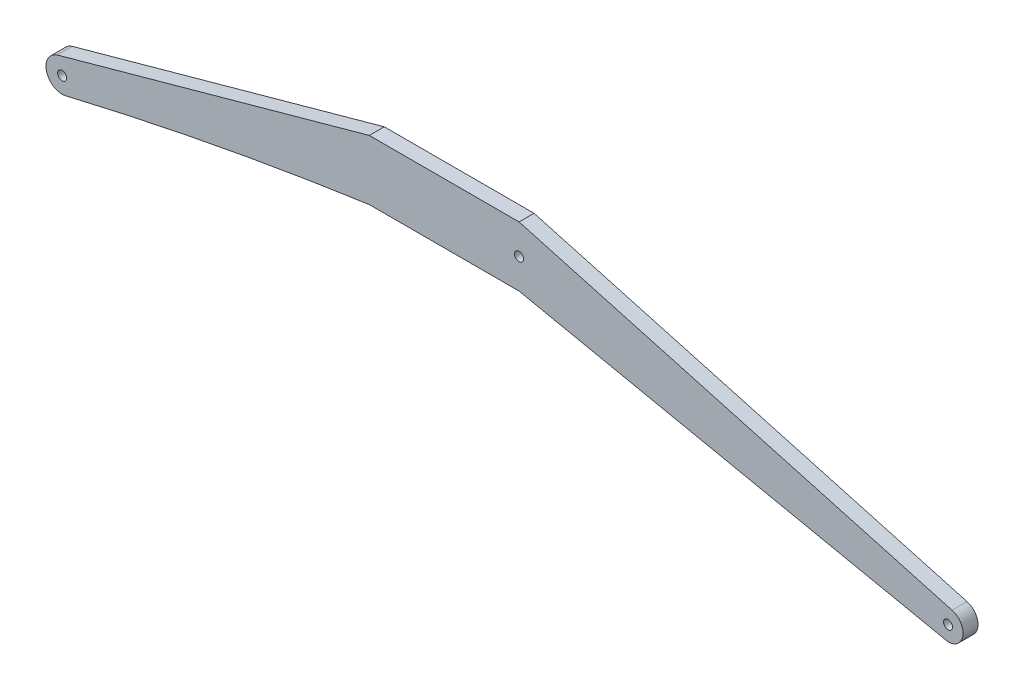
ISO-10303-21;
HEADER;
FILE_DESCRIPTION(('STEP AP214'),'2;1');
FILE_NAME('part.step','',(''),(''),'','','');
FILE_SCHEMA(('AUTOMOTIVE_DESIGN { 1 0 10303 214 1 1 1 1 }'));
ENDSEC;
DATA;
#1=APPLICATION_CONTEXT('core data for automotive mechanical design processes');
#2=APPLICATION_PROTOCOL_DEFINITION('international standard','automotive_design',2000,#1);
#3=PRODUCT_CONTEXT('',#1,'mechanical');
#4=PRODUCT('Part','Part','',(#3));
#5=PRODUCT_RELATED_PRODUCT_CATEGORY('part','',(#4));
#6=PRODUCT_DEFINITION_FORMATION('','',#4);
#7=PRODUCT_DEFINITION_CONTEXT('part definition',#1,'design');
#8=PRODUCT_DEFINITION('design','',#6,#7);
#9=PRODUCT_DEFINITION_SHAPE('','',#8);
#10=(LENGTH_UNIT() NAMED_UNIT(*) SI_UNIT(.MILLI.,.METRE.));
#11=(NAMED_UNIT(*) PLANE_ANGLE_UNIT() SI_UNIT($,.RADIAN.));
#12=(NAMED_UNIT(*) SI_UNIT($,.STERADIAN.) SOLID_ANGLE_UNIT());
#13=UNCERTAINTY_MEASURE_WITH_UNIT(LENGTH_MEASURE(1.E-05),#10,'distance_accuracy_value','');
#14=(GEOMETRIC_REPRESENTATION_CONTEXT(3) GLOBAL_UNCERTAINTY_ASSIGNED_CONTEXT((#13)) GLOBAL_UNIT_ASSIGNED_CONTEXT((#10,
#11,#12)) REPRESENTATION_CONTEXT('',''));
#15=CARTESIAN_POINT('',(0.,0.,0.));
#16=DIRECTION('',(0.,0.,1.));
#17=DIRECTION('',(1.,0.,0.));
#18=AXIS2_PLACEMENT_3D('',#15,#16,#17);
#19=CARTESIAN_POINT('',(-25.5100344515738,-5.62123459327254,1.));
#20=DIRECTION('',(0.,0.,-1.));
#21=DIRECTION('',(-1.,0.,0.));
#22=AXIS2_PLACEMENT_3D('',#19,#20,#21);
#23=CYLINDRICAL_SURFACE('',#22,1.0782818882512);
#24=CARTESIAN_POINT('',(-25.5100344515738,-5.62123459327254,0.));
#25=DIRECTION('',(0.,0.,1.));
#26=DIRECTION('',(1.,0.,0.));
#27=AXIS2_PLACEMENT_3D('',#24,#25,#26);
#28=CIRCLE('',#27,1.0782818882512);
#29=CARTESIAN_POINT('',(-25.8358261445183,-4.59334763288295,0.));
#30=VERTEX_POINT('',#29);
#31=CARTESIAN_POINT('',(-25.2611361471443,-6.67039686126672,0.));
#32=VERTEX_POINT('',#31);
#33=EDGE_CURVE('E142',#30,#32,#28,.T.);
#34=ORIENTED_EDGE('',*,*,#33,.T.);
#35=DIRECTION('',(0.,0.,-1.));
#36=VECTOR('',#35,1.);
#37=CARTESIAN_POINT('',(-25.2611361471443,-6.67039686126672,1.));
#38=LINE('',#37,#36);
#39=CARTESIAN_POINT('',(-25.2611361471443,-6.67039686126672,1.));
#40=VERTEX_POINT('',#39);
#41=EDGE_CURVE('E11',#40,#32,#38,.T.);
#42=ORIENTED_EDGE('',*,*,#41,.F.);
#43=CARTESIAN_POINT('',(-25.5100344515738,-5.62123459327254,1.));
#44=DIRECTION('',(0.,0.,1.));
#45=DIRECTION('',(1.,0.,0.));
#46=AXIS2_PLACEMENT_3D('',#43,#44,#45);
#47=CIRCLE('',#46,1.0782818882512);
#48=CARTESIAN_POINT('',(-25.8358261445183,-4.59334763288295,1.));
#49=VERTEX_POINT('',#48);
#50=EDGE_CURVE('E168',#49,#40,#47,.T.);
#51=ORIENTED_EDGE('',*,*,#50,.F.);
#52=DIRECTION('',(0.,0.,-1.));
#53=VECTOR('',#52,1.);
#54=CARTESIAN_POINT('',(-25.8358261445183,-4.59334763288295,1.));
#55=LINE('',#54,#53);
#56=EDGE_CURVE('E141',#49,#30,#55,.T.);
#57=ORIENTED_EDGE('',*,*,#56,.T.);
#58=EDGE_LOOP('',(#34,#42,#51,#57));
#59=FACE_BOUND('',#58,.T.);
#60=ADVANCED_FACE('F38',(#59),#23,.T.);
#61=CARTESIAN_POINT('',(27.0336145789465,-227.104519149604,1.));
#62=DIRECTION('',(0.,0.,-1.));
#63=DIRECTION('',(-1.,0.,0.));
#64=AXIS2_PLACEMENT_3D('',#61,#62,#63);
#65=CYLINDRICAL_SURFACE('',#64,226.552296882053);
#66=CARTESIAN_POINT('',(27.0336145789465,-227.104519149604,0.));
#67=DIRECTION('',(0.,0.,1.));
#68=DIRECTION('',(1.,0.,0.));
#69=AXIS2_PLACEMENT_3D('',#66,#67,#68);
#70=CIRCLE('',#69,226.552296882053);
#71=CARTESIAN_POINT('',(-4.99999999999999,-2.8283707085781,0.));
#72=VERTEX_POINT('',#71);
#73=EDGE_CURVE('E145',#32,#72,#70,.F.);
#74=ORIENTED_EDGE('',*,*,#73,.T.);
#75=DIRECTION('',(0.,0.,-1.));
#76=VECTOR('',#75,1.);
#77=CARTESIAN_POINT('',(-4.99999999999999,-2.8283707085781,1.));
#78=LINE('',#77,#76);
#79=CARTESIAN_POINT('',(-4.99999999999999,-2.8283707085781,1.));
#80=VERTEX_POINT('',#79);
#81=EDGE_CURVE('E46',#80,#72,#78,.T.);
#82=ORIENTED_EDGE('',*,*,#81,.F.);
#83=CARTESIAN_POINT('',(27.0336145789465,-227.104519149604,1.));
#84=DIRECTION('',(0.,0.,1.));
#85=DIRECTION('',(1.,0.,0.));
#86=AXIS2_PLACEMENT_3D('',#83,#84,#85);
#87=CIRCLE('',#86,226.552296882053);
#88=EDGE_CURVE('E93',#40,#80,#87,.F.);
#89=ORIENTED_EDGE('',*,*,#88,.F.);
#90=ORIENTED_EDGE('',*,*,#41,.T.);
#91=EDGE_LOOP('',(#74,#82,#89,#90));
#92=FACE_BOUND('',#91,.T.);
#93=ADVANCED_FACE('F201',(#92),#65,.F.);
#94=CARTESIAN_POINT('',(-3.35477907951799E-13,-2.82837070857869,1.));
#95=DIRECTION('',(1.18611717669917E-13,1.,0.));
#96=DIRECTION('',(-1.,1.18611717669917E-13,0.));
#97=AXIS2_PLACEMENT_3D('',#94,#95,#96);
#98=PLANE('',#97);
#99=DIRECTION('',(1.,-1.18611717669917E-13,0.));
#100=VECTOR('',#99,1.);
#101=CARTESIAN_POINT('',(-3.35477907951799E-13,-2.82837070857869,0.));
#102=LINE('',#101,#100);
#103=CARTESIAN_POINT('',(4.99999999999977,-2.82837070857928,0.));
#104=VERTEX_POINT('',#103);
#105=EDGE_CURVE('E147',#72,#104,#102,.T.);
#106=ORIENTED_EDGE('',*,*,#105,.T.);
#107=DIRECTION('',(0.,0.,-1.));
#108=VECTOR('',#107,1.);
#109=CARTESIAN_POINT('',(4.99999999999977,-2.82837070857928,1.));
#110=LINE('',#109,#108);
#111=CARTESIAN_POINT('',(4.99999999999977,-2.82837070857928,1.));
#112=VERTEX_POINT('',#111);
#113=EDGE_CURVE('E174',#112,#104,#110,.T.);
#114=ORIENTED_EDGE('',*,*,#113,.F.);
#115=DIRECTION('',(1.,-1.18611717669917E-13,0.));
#116=VECTOR('',#115,1.);
#117=CARTESIAN_POINT('',(-3.35477907951799E-13,-2.82837070857869,1.));
#118=LINE('',#117,#116);
#119=EDGE_CURVE('E182',#80,#112,#118,.T.);
#120=ORIENTED_EDGE('',*,*,#119,.F.);
#121=ORIENTED_EDGE('',*,*,#81,.T.);
#122=EDGE_LOOP('',(#106,#114,#120,#121));
#123=FACE_BOUND('',#122,.T.);
#124=ADVANCED_FACE('F180',(#123),#98,.F.);
#125=CARTESIAN_POINT('',(-0.356659598653028,-1.71321069386963,1.));
#126=DIRECTION('',(0.203812241610398,0.97900999492842,0.));
#127=DIRECTION('',(-0.97900999492842,0.203812241610398,0.));
#128=AXIS2_PLACEMENT_3D('',#125,#126,#127);
#129=PLANE('',#128);
#130=DIRECTION('',(0.97900999492842,-0.203812241610398,0.));
#131=VECTOR('',#130,1.);
#132=CARTESIAN_POINT('',(-0.356659598653028,-1.71321069386963,0.));
#133=LINE('',#132,#131);
#134=CARTESIAN_POINT('',(33.6469979229353,-8.7921595282315,0.));
#135=VERTEX_POINT('',#134);
#136=EDGE_CURVE('E149',#104,#135,#133,.T.);
#137=ORIENTED_EDGE('',*,*,#136,.T.);
#138=DIRECTION('',(0.,0.,-1.));
#139=VECTOR('',#138,1.);
#140=CARTESIAN_POINT('',(33.6469979229353,-8.7921595282315,1.));
#141=LINE('',#140,#139);
#142=CARTESIAN_POINT('',(33.6469979229353,-8.7921595282315,1.));
#143=VERTEX_POINT('',#142);
#144=EDGE_CURVE('E172',#143,#135,#141,.T.);
#145=ORIENTED_EDGE('',*,*,#144,.F.);
#146=DIRECTION('',(0.97900999492842,-0.203812241610398,0.));
#147=VECTOR('',#146,1.);
#148=CARTESIAN_POINT('',(-0.356659598653028,-1.71321069386963,1.));
#149=LINE('',#148,#147);
#150=EDGE_CURVE('E193',#112,#143,#149,.T.);
#151=ORIENTED_EDGE('',*,*,#150,.F.);
#152=ORIENTED_EDGE('',*,*,#113,.T.);
#153=EDGE_LOOP('',(#137,#145,#151,#152));
#154=FACE_BOUND('',#153,.T.);
#155=ADVANCED_FACE('F191',(#154),#129,.F.);
#156=CARTESIAN_POINT('',(33.6469979229353,-7.7921595282315,1.));
#157=DIRECTION('',(0.,0.,-1.));
#158=DIRECTION('',(-1.,0.,0.));
#159=AXIS2_PLACEMENT_3D('',#156,#157,#158);
#160=CYLINDRICAL_SURFACE('',#159,1.00000000000004);
#161=CARTESIAN_POINT('',(33.6469979229353,-7.7921595282315,0.));
#162=DIRECTION('',(0.,0.,1.));
#163=DIRECTION('',(1.,0.,0.));
#164=AXIS2_PLACEMENT_3D('',#161,#162,#163);
#165=CIRCLE('',#164,1.00000000000004);
#166=CARTESIAN_POINT('',(33.9136645896019,-6.8283707085781,0.));
#167=VERTEX_POINT('',#166);
#168=EDGE_CURVE('E152',#167,#135,#165,.F.);
#169=ORIENTED_EDGE('',*,*,#168,.F.);
#170=DIRECTION('',(0.,0.,-1.));
#171=VECTOR('',#170,1.);
#172=CARTESIAN_POINT('',(33.9136645896019,-6.8283707085781,1.));
#173=LINE('',#172,#171);
#174=CARTESIAN_POINT('',(33.9136645896019,-6.8283707085781,1.));
#175=VERTEX_POINT('',#174);
#176=EDGE_CURVE('E118',#175,#167,#173,.T.);
#177=ORIENTED_EDGE('',*,*,#176,.F.);
#178=CARTESIAN_POINT('',(33.6469979229353,-7.7921595282315,1.));
#179=DIRECTION('',(0.,0.,1.));
#180=DIRECTION('',(1.,0.,0.));
#181=AXIS2_PLACEMENT_3D('',#178,#179,#180);
#182=CIRCLE('',#181,1.00000000000004);
#183=EDGE_CURVE('E125',#175,#143,#182,.F.);
#184=ORIENTED_EDGE('',*,*,#183,.T.);
#185=ORIENTED_EDGE('',*,*,#144,.T.);
#186=EDGE_LOOP('',(#169,#177,#184,#185));
#187=FACE_BOUND('',#186,.T.);
#188=ADVANCED_FACE('F211',(#187),#160,.T.);
#189=CARTESIAN_POINT('',(0.656676412049121,2.37336519023644,1.));
#190=DIRECTION('',(0.266666666666667,0.963788819653397,0.));
#191=DIRECTION('',(-0.963788819653397,0.266666666666667,0.));
#192=AXIS2_PLACEMENT_3D('',#189,#190,#191);
#193=PLANE('',#192);
#194=DIRECTION('',(0.963788819653397,-0.266666666666667,0.));
#195=VECTOR('',#194,1.);
#196=CARTESIAN_POINT('',(0.656676412049121,2.37336519023644,0.));
#197=LINE('',#196,#195);
#198=CARTESIAN_POINT('',(5.00000000000002,1.1716292914219,0.));
#199=VERTEX_POINT('',#198);
#200=EDGE_CURVE('E113',#199,#167,#197,.T.);
#201=ORIENTED_EDGE('',*,*,#200,.F.);
#202=DIRECTION('',(0.,0.,-1.));
#203=VECTOR('',#202,1.);
#204=CARTESIAN_POINT('',(5.00000000000002,1.1716292914219,1.));
#205=LINE('',#204,#203);
#206=CARTESIAN_POINT('',(5.00000000000002,1.1716292914219,1.));
#207=VERTEX_POINT('',#206);
#208=EDGE_CURVE('E108',#207,#199,#205,.T.);
#209=ORIENTED_EDGE('',*,*,#208,.F.);
#210=DIRECTION('',(0.963788819653397,-0.266666666666667,0.));
#211=VECTOR('',#210,1.);
#212=CARTESIAN_POINT('',(0.656676412049121,2.37336519023644,1.));
#213=LINE('',#212,#211);
#214=EDGE_CURVE('E111',#207,#175,#213,.T.);
#215=ORIENTED_EDGE('',*,*,#214,.T.);
#216=ORIENTED_EDGE('',*,*,#176,.T.);
#217=EDGE_LOOP('',(#201,#209,#215,#216));
#218=FACE_BOUND('',#217,.T.);
#219=ADVANCED_FACE('F110',(#218),#193,.T.);
#220=CARTESIAN_POINT('',(0.,1.17162929142192,1.));
#221=DIRECTION('',(0.,1.,0.));
#222=DIRECTION('',(-1.,0.,0.));
#223=AXIS2_PLACEMENT_3D('',#220,#221,#222);
#224=PLANE('',#223);
#225=DIRECTION('',(1.,0.,0.));
#226=VECTOR('',#225,1.);
#227=CARTESIAN_POINT('',(0.,1.17162929142192,0.));
#228=LINE('',#227,#226);
#229=CARTESIAN_POINT('',(-4.99999999987469,1.17162929142193,0.));
#230=VERTEX_POINT('',#229);
#231=EDGE_CURVE('E156',#230,#199,#228,.T.);
#232=ORIENTED_EDGE('',*,*,#231,.F.);
#233=DIRECTION('',(0.,0.,-1.));
#234=VECTOR('',#233,1.);
#235=CARTESIAN_POINT('',(-4.99999999987469,1.17162929142193,1.));
#236=LINE('',#235,#234);
#237=CARTESIAN_POINT('',(-4.99999999987469,1.17162929142193,1.));
#238=VERTEX_POINT('',#237);
#239=EDGE_CURVE('E82',#238,#230,#236,.T.);
#240=ORIENTED_EDGE('',*,*,#239,.F.);
#241=DIRECTION('',(1.,0.,0.));
#242=VECTOR('',#241,1.);
#243=CARTESIAN_POINT('',(0.,1.17162929142192,1.));
#244=LINE('',#243,#242);
#245=EDGE_CURVE('E123',#238,#207,#244,.T.);
#246=ORIENTED_EDGE('',*,*,#245,.T.);
#247=ORIENTED_EDGE('',*,*,#208,.T.);
#248=EDGE_LOOP('',(#232,#240,#246,#247));
#249=FACE_BOUND('',#248,.T.);
#250=ADVANCED_FACE('F127',(#249),#224,.T.);
#251=CARTESIAN_POINT('',(5.00000000000001,-0.828370708578096,1.));
#252=DIRECTION('',(0.,0.,-1.));
#253=DIRECTION('',(-1.,0.,0.));
#254=AXIS2_PLACEMENT_3D('',#251,#252,#253);
#255=CYLINDRICAL_SURFACE('',#254,0.3);
#256=CARTESIAN_POINT('',(5.00000000000001,-0.828370708578096,1.));
#257=DIRECTION('',(0.,0.,1.));
#258=DIRECTION('',(1.,0.,0.));
#259=AXIS2_PLACEMENT_3D('',#256,#257,#258);
#260=CIRCLE('',#259,0.3);
#261=CARTESIAN_POINT('',(5.30000000000001,-0.828370708578096,1.));
#262=VERTEX_POINT('',#261);
#263=EDGE_CURVE('E135',#262,#262,#260,.T.);
#264=ORIENTED_EDGE('',*,*,#263,.T.);
#265=EDGE_LOOP('',(#264));
#266=FACE_BOUND('',#265,.T.);
#267=CARTESIAN_POINT('',(5.00000000000001,-0.828370708578096,0.));
#268=DIRECTION('',(0.,0.,1.));
#269=DIRECTION('',(1.,0.,0.));
#270=AXIS2_PLACEMENT_3D('',#267,#268,#269);
#271=CIRCLE('',#270,0.3);
#272=CARTESIAN_POINT('',(5.30000000000001,-0.828370708578096,0.));
#273=VERTEX_POINT('',#272);
#274=EDGE_CURVE('E162',#273,#273,#271,.T.);
#275=ORIENTED_EDGE('',*,*,#274,.F.);
#276=EDGE_LOOP('',(#275));
#277=FACE_BOUND('',#276,.T.);
#278=ADVANCED_FACE('F219',(#266,#277),#255,.F.);
#279=CARTESIAN_POINT('',(-25.5100344515738,-5.62123459327254,1.));
#280=DIRECTION('',(0.,0.,-1.));
#281=DIRECTION('',(-1.,0.,0.));
#282=AXIS2_PLACEMENT_3D('',#279,#280,#281);
#283=CYLINDRICAL_SURFACE('',#282,0.3);
#284=CARTESIAN_POINT('',(-25.5100344515738,-5.62123459327254,1.));
#285=DIRECTION('',(0.,0.,1.));
#286=DIRECTION('',(1.,0.,0.));
#287=AXIS2_PLACEMENT_3D('',#284,#285,#286);
#288=CIRCLE('',#287,0.3);
#289=CARTESIAN_POINT('',(-25.2100344515738,-5.62123459327254,1.));
#290=VERTEX_POINT('',#289);
#291=EDGE_CURVE('E129',#290,#290,#288,.T.);
#292=ORIENTED_EDGE('',*,*,#291,.T.);
#293=EDGE_LOOP('',(#292));
#294=FACE_BOUND('',#293,.T.);
#295=CARTESIAN_POINT('',(-25.5100344515738,-5.62123459327254,0.));
#296=DIRECTION('',(0.,0.,1.));
#297=DIRECTION('',(1.,0.,0.));
#298=AXIS2_PLACEMENT_3D('',#295,#296,#297);
#299=CIRCLE('',#298,0.3);
#300=CARTESIAN_POINT('',(-25.2100344515738,-5.62123459327254,0.));
#301=VERTEX_POINT('',#300);
#302=EDGE_CURVE('E159',#301,#301,#299,.T.);
#303=ORIENTED_EDGE('',*,*,#302,.F.);
#304=EDGE_LOOP('',(#303));
#305=FACE_BOUND('',#304,.T.);
#306=ADVANCED_FACE('F224',(#294,#305),#283,.F.);
#307=CARTESIAN_POINT('',(-0.656676412034687,2.37336519019855,1.));
#308=DIRECTION('',(0.266666666665177,-0.96378881965381,0.));
#309=DIRECTION('',(0.96378881965381,0.266666666665177,0.));
#310=AXIS2_PLACEMENT_3D('',#307,#308,#309);
#311=PLANE('',#310);
#312=DIRECTION('',(-0.96378881965381,-0.266666666665177,0.));
#313=VECTOR('',#312,1.);
#314=CARTESIAN_POINT('',(-0.656676412034687,2.37336519019855,0.));
#315=LINE('',#314,#313);
#316=EDGE_CURVE('E85',#230,#30,#315,.T.);
#317=ORIENTED_EDGE('',*,*,#316,.T.);
#318=ORIENTED_EDGE('',*,*,#56,.F.);
#319=DIRECTION('',(-0.96378881965381,-0.266666666665177,0.));
#320=VECTOR('',#319,1.);
#321=CARTESIAN_POINT('',(-0.656676412034687,2.37336519019855,1.));
#322=LINE('',#321,#320);
#323=EDGE_CURVE('E54',#238,#49,#322,.T.);
#324=ORIENTED_EDGE('',*,*,#323,.F.);
#325=ORIENTED_EDGE('',*,*,#239,.T.);
#326=EDGE_LOOP('',(#317,#318,#324,#325));
#327=FACE_BOUND('',#326,.T.);
#328=ADVANCED_FACE('F220',(#327),#311,.F.);
#329=CARTESIAN_POINT('',(33.6469979229353,-7.7921595282315,1.));
#330=DIRECTION('',(0.,0.,-1.));
#331=DIRECTION('',(-1.,0.,0.));
#332=AXIS2_PLACEMENT_3D('',#329,#330,#331);
#333=CYLINDRICAL_SURFACE('',#332,0.300000000000003);
#334=CARTESIAN_POINT('',(33.6469979229353,-7.7921595282315,1.));
#335=DIRECTION('',(0.,0.,1.));
#336=DIRECTION('',(1.,0.,0.));
#337=AXIS2_PLACEMENT_3D('',#334,#335,#336);
#338=CIRCLE('',#337,0.300000000000003);
#339=CARTESIAN_POINT('',(33.9469979229353,-7.7921595282315,1.));
#340=VERTEX_POINT('',#339);
#341=EDGE_CURVE('E138',#340,#340,#338,.F.);
#342=ORIENTED_EDGE('',*,*,#341,.F.);
#343=EDGE_LOOP('',(#342));
#344=FACE_BOUND('',#343,.T.);
#345=CARTESIAN_POINT('',(33.6469979229353,-7.7921595282315,0.));
#346=DIRECTION('',(0.,0.,1.));
#347=DIRECTION('',(1.,0.,0.));
#348=AXIS2_PLACEMENT_3D('',#345,#346,#347);
#349=CIRCLE('',#348,0.300000000000003);
#350=CARTESIAN_POINT('',(33.9469979229353,-7.7921595282315,0.));
#351=VERTEX_POINT('',#350);
#352=EDGE_CURVE('E165',#351,#351,#349,.F.);
#353=ORIENTED_EDGE('',*,*,#352,.T.);
#354=EDGE_LOOP('',(#353));
#355=FACE_BOUND('',#354,.T.);
#356=ADVANCED_FACE('F223',(#344,#355),#333,.F.);
#357=CARTESIAN_POINT('',(0.,0.,1.));
#358=DIRECTION('',(0.,0.,1.));
#359=DIRECTION('',(1.,0.,0.));
#360=AXIS2_PLACEMENT_3D('',#357,#358,#359);
#361=PLANE('',#360);
#362=ORIENTED_EDGE('',*,*,#50,.T.);
#363=ORIENTED_EDGE('',*,*,#88,.T.);
#364=ORIENTED_EDGE('',*,*,#119,.T.);
#365=ORIENTED_EDGE('',*,*,#150,.T.);
#366=ORIENTED_EDGE('',*,*,#183,.F.);
#367=ORIENTED_EDGE('',*,*,#214,.F.);
#368=ORIENTED_EDGE('',*,*,#245,.F.);
#369=ORIENTED_EDGE('',*,*,#323,.T.);
#370=EDGE_LOOP('',(#362,#363,#364,#365,#366,#367,#368,#369));
#371=FACE_BOUND('',#370,.T.);
#372=ORIENTED_EDGE('',*,*,#291,.F.);
#373=EDGE_LOOP('',(#372));
#374=FACE_BOUND('',#373,.T.);
#375=ORIENTED_EDGE('',*,*,#263,.F.);
#376=EDGE_LOOP('',(#375));
#377=FACE_BOUND('',#376,.T.);
#378=ORIENTED_EDGE('',*,*,#341,.T.);
#379=EDGE_LOOP('',(#378));
#380=FACE_BOUND('',#379,.T.);
#381=ADVANCED_FACE('F121',(#371,#374,#377,#380),#361,.T.);
#382=CARTESIAN_POINT('',(0.,0.,0.));
#383=DIRECTION('',(0.,0.,1.));
#384=DIRECTION('',(1.,0.,0.));
#385=AXIS2_PLACEMENT_3D('',#382,#383,#384);
#386=PLANE('',#385);
#387=ORIENTED_EDGE('',*,*,#33,.F.);
#388=ORIENTED_EDGE('',*,*,#316,.F.);
#389=ORIENTED_EDGE('',*,*,#231,.T.);
#390=ORIENTED_EDGE('',*,*,#200,.T.);
#391=ORIENTED_EDGE('',*,*,#168,.T.);
#392=ORIENTED_EDGE('',*,*,#136,.F.);
#393=ORIENTED_EDGE('',*,*,#105,.F.);
#394=ORIENTED_EDGE('',*,*,#73,.F.);
#395=EDGE_LOOP('',(#387,#388,#389,#390,#391,#392,#393,#394));
#396=FACE_BOUND('',#395,.T.);
#397=ORIENTED_EDGE('',*,*,#302,.T.);
#398=EDGE_LOOP('',(#397));
#399=FACE_BOUND('',#398,.T.);
#400=ORIENTED_EDGE('',*,*,#274,.T.);
#401=EDGE_LOOP('',(#400));
#402=FACE_BOUND('',#401,.T.);
#403=ORIENTED_EDGE('',*,*,#352,.F.);
#404=EDGE_LOOP('',(#403));
#405=FACE_BOUND('',#404,.T.);
#406=ADVANCED_FACE('F186',(#396,#399,#402,#405),#386,.F.);
#407=CLOSED_SHELL('',(#60,#93,#124,#155,#188,#219,#250,#278,#306,#328,#356,#381,#406));
#408=MANIFOLD_SOLID_BREP('B2',#407);
#409=ADVANCED_BREP_SHAPE_REPRESENTATION('',(#18,#408),#14);
#410=SHAPE_DEFINITION_REPRESENTATION(#9,#409);
ENDSEC;
END-ISO-10303-21;
